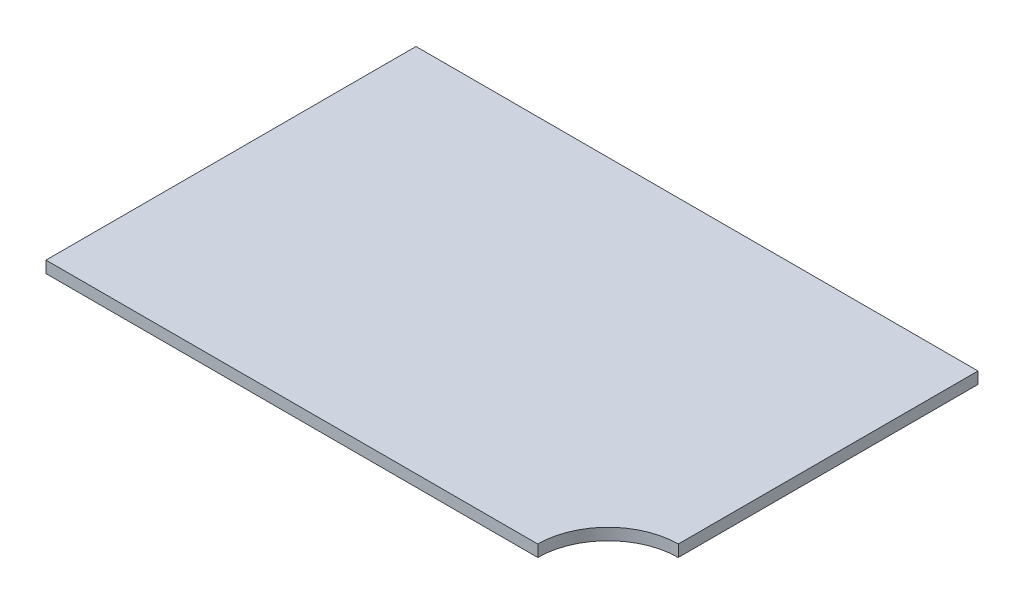
ISO-10303-21;
HEADER;
FILE_DESCRIPTION(('STEP AP214'),'2;1');
FILE_NAME('part.step','',(''),(''),'','','');
FILE_SCHEMA(('AUTOMOTIVE_DESIGN { 1 0 10303 214 1 1 1 1 }'));
ENDSEC;
DATA;
#1=APPLICATION_CONTEXT('core data for automotive mechanical design processes');
#2=APPLICATION_PROTOCOL_DEFINITION('international standard','automotive_design',2000,#1);
#3=PRODUCT_CONTEXT('',#1,'mechanical');
#4=PRODUCT('Part','Part','',(#3));
#5=PRODUCT_RELATED_PRODUCT_CATEGORY('part','',(#4));
#6=PRODUCT_DEFINITION_FORMATION('','',#4);
#7=PRODUCT_DEFINITION_CONTEXT('part definition',#1,'design');
#8=PRODUCT_DEFINITION('design','',#6,#7);
#9=PRODUCT_DEFINITION_SHAPE('','',#8);
#10=(LENGTH_UNIT() NAMED_UNIT(*) SI_UNIT(.MILLI.,.METRE.));
#11=(NAMED_UNIT(*) PLANE_ANGLE_UNIT() SI_UNIT($,.RADIAN.));
#12=(NAMED_UNIT(*) SI_UNIT($,.STERADIAN.) SOLID_ANGLE_UNIT());
#13=UNCERTAINTY_MEASURE_WITH_UNIT(LENGTH_MEASURE(1.E-05),#10,'distance_accuracy_value','');
#14=(GEOMETRIC_REPRESENTATION_CONTEXT(3) GLOBAL_UNCERTAINTY_ASSIGNED_CONTEXT((#13)) GLOBAL_UNIT_ASSIGNED_CONTEXT((#10,
#11,#12)) REPRESENTATION_CONTEXT('',''));
#15=CARTESIAN_POINT('',(0.,0.,0.));
#16=DIRECTION('',(0.,0.,1.));
#17=DIRECTION('',(1.,0.,0.));
#18=AXIS2_PLACEMENT_3D('',#15,#16,#17);
#19=CARTESIAN_POINT('',(-120.,5.,0.));
#20=DIRECTION('',(1.,0.,0.));
#21=DIRECTION('',(0.,0.,-1.));
#22=AXIS2_PLACEMENT_3D('',#19,#20,#21);
#23=PLANE('',#22);
#24=DIRECTION('',(0.,0.,1.));
#25=VECTOR('',#24,1.);
#26=CARTESIAN_POINT('',(-120.,0.,0.));
#27=LINE('',#26,#25);
#28=CARTESIAN_POINT('',(-120.,0.,0.));
#29=VERTEX_POINT('',#28);
#30=CARTESIAN_POINT('',(-120.,0.,158.));
#31=VERTEX_POINT('',#30);
#32=EDGE_CURVE('E115',#29,#31,#27,.T.);
#33=ORIENTED_EDGE('',*,*,#32,.T.);
#34=DIRECTION('',(0.,-1.,0.));
#35=VECTOR('',#34,1.);
#36=CARTESIAN_POINT('',(-120.,5.,158.));
#37=LINE('',#36,#35);
#38=CARTESIAN_POINT('',(-120.,5.,158.));
#39=VERTEX_POINT('',#38);
#40=EDGE_CURVE('E11',#39,#31,#37,.T.);
#41=ORIENTED_EDGE('',*,*,#40,.F.);
#42=DIRECTION('',(0.,0.,1.));
#43=VECTOR('',#42,1.);
#44=CARTESIAN_POINT('',(-120.,5.,0.));
#45=LINE('',#44,#43);
#46=CARTESIAN_POINT('',(-120.,5.,0.));
#47=VERTEX_POINT('',#46);
#48=EDGE_CURVE('E111',#47,#39,#45,.T.);
#49=ORIENTED_EDGE('',*,*,#48,.F.);
#50=DIRECTION('',(0.,-1.,0.));
#51=VECTOR('',#50,1.);
#52=CARTESIAN_POINT('',(-120.,5.,0.));
#53=LINE('',#52,#51);
#54=EDGE_CURVE('E109',#47,#29,#53,.T.);
#55=ORIENTED_EDGE('',*,*,#54,.T.);
#56=EDGE_LOOP('',(#33,#41,#49,#55));
#57=FACE_BOUND('',#56,.T.);
#58=ADVANCED_FACE('F41',(#57),#23,.F.);
#59=CARTESIAN_POINT('',(-120.,5.,158.));
#60=DIRECTION('',(0.,0.,-1.));
#61=DIRECTION('',(-1.,0.,0.));
#62=AXIS2_PLACEMENT_3D('',#59,#60,#61);
#63=PLANE('',#62);
#64=DIRECTION('',(1.,0.,0.));
#65=VECTOR('',#64,1.);
#66=CARTESIAN_POINT('',(-120.,0.,158.));
#67=LINE('',#66,#65);
#68=CARTESIAN_POINT('',(90.,0.,158.));
#69=VERTEX_POINT('',#68);
#70=EDGE_CURVE('E118',#31,#69,#67,.T.);
#71=ORIENTED_EDGE('',*,*,#70,.T.);
#72=DIRECTION('',(0.,-1.,0.));
#73=VECTOR('',#72,1.);
#74=CARTESIAN_POINT('',(90.,5.,158.));
#75=LINE('',#74,#73);
#76=CARTESIAN_POINT('',(90.,5.,158.));
#77=VERTEX_POINT('',#76);
#78=EDGE_CURVE('E55',#77,#69,#75,.T.);
#79=ORIENTED_EDGE('',*,*,#78,.F.);
#80=DIRECTION('',(1.,0.,0.));
#81=VECTOR('',#80,1.);
#82=CARTESIAN_POINT('',(-120.,5.,158.));
#83=LINE('',#82,#81);
#84=EDGE_CURVE('E86',#39,#77,#83,.T.);
#85=ORIENTED_EDGE('',*,*,#84,.F.);
#86=ORIENTED_EDGE('',*,*,#40,.T.);
#87=EDGE_LOOP('',(#71,#79,#85,#86));
#88=FACE_BOUND('',#87,.T.);
#89=ADVANCED_FACE('F133',(#88),#63,.F.);
#90=CARTESIAN_POINT('',(120.,5.,0.));
#91=DIRECTION('',(-1.,0.,0.));
#92=DIRECTION('',(0.,0.,1.));
#93=AXIS2_PLACEMENT_3D('',#90,#91,#92);
#94=PLANE('',#93);
#95=DIRECTION('',(0.,0.,-1.));
#96=VECTOR('',#95,1.);
#97=CARTESIAN_POINT('',(120.,5.,0.));
#98=LINE('',#97,#96);
#99=CARTESIAN_POINT('',(120.,5.,128.));
#100=VERTEX_POINT('',#99);
#101=CARTESIAN_POINT('',(120.,5.,0.));
#102=VERTEX_POINT('',#101);
#103=EDGE_CURVE('E104',#100,#102,#98,.T.);
#104=ORIENTED_EDGE('',*,*,#103,.F.);
#105=DIRECTION('',(0.,-1.,0.));
#106=VECTOR('',#105,1.);
#107=CARTESIAN_POINT('',(120.,5.,128.));
#108=LINE('',#107,#106);
#109=CARTESIAN_POINT('',(120.,0.,128.));
#110=VERTEX_POINT('',#109);
#111=EDGE_CURVE('E94',#100,#110,#108,.T.);
#112=ORIENTED_EDGE('',*,*,#111,.T.);
#113=DIRECTION('',(0.,0.,-1.));
#114=VECTOR('',#113,1.);
#115=CARTESIAN_POINT('',(120.,0.,0.));
#116=LINE('',#115,#114);
#117=CARTESIAN_POINT('',(120.,0.,0.));
#118=VERTEX_POINT('',#117);
#119=EDGE_CURVE('E121',#110,#118,#116,.T.);
#120=ORIENTED_EDGE('',*,*,#119,.T.);
#121=DIRECTION('',(0.,-1.,0.));
#122=VECTOR('',#121,1.);
#123=CARTESIAN_POINT('',(120.,5.,0.));
#124=LINE('',#123,#122);
#125=EDGE_CURVE('E48',#102,#118,#124,.T.);
#126=ORIENTED_EDGE('',*,*,#125,.F.);
#127=EDGE_LOOP('',(#104,#112,#120,#126));
#128=FACE_BOUND('',#127,.T.);
#129=ADVANCED_FACE('F107',(#128),#94,.F.);
#130=CARTESIAN_POINT('',(-120.,5.,0.));
#131=DIRECTION('',(0.,0.,1.));
#132=DIRECTION('',(1.,0.,0.));
#133=AXIS2_PLACEMENT_3D('',#130,#131,#132);
#134=PLANE('',#133);
#135=DIRECTION('',(-1.,0.,0.));
#136=VECTOR('',#135,1.);
#137=CARTESIAN_POINT('',(-120.,0.,0.));
#138=LINE('',#137,#136);
#139=EDGE_CURVE('E81',#118,#29,#138,.T.);
#140=ORIENTED_EDGE('',*,*,#139,.T.);
#141=ORIENTED_EDGE('',*,*,#54,.F.);
#142=DIRECTION('',(-1.,0.,0.));
#143=VECTOR('',#142,1.);
#144=CARTESIAN_POINT('',(-120.,5.,0.));
#145=LINE('',#144,#143);
#146=EDGE_CURVE('E64',#102,#47,#145,.T.);
#147=ORIENTED_EDGE('',*,*,#146,.F.);
#148=ORIENTED_EDGE('',*,*,#125,.T.);
#149=EDGE_LOOP('',(#140,#141,#147,#148));
#150=FACE_BOUND('',#149,.T.);
#151=ADVANCED_FACE('F124',(#150),#134,.F.);
#152=CARTESIAN_POINT('',(0.,5.,0.));
#153=DIRECTION('',(0.,1.,0.));
#154=DIRECTION('',(0.,0.,1.));
#155=AXIS2_PLACEMENT_3D('',#152,#153,#154);
#156=PLANE('',#155);
#157=CARTESIAN_POINT('',(120.,5.,158.));
#158=DIRECTION('',(0.,-1.,0.));
#159=DIRECTION('',(0.,0.,1.));
#160=AXIS2_PLACEMENT_3D('',#157,#158,#159);
#161=CIRCLE('',#160,30.);
#162=EDGE_CURVE('E97',#77,#100,#161,.T.);
#163=ORIENTED_EDGE('',*,*,#162,.T.);
#164=ORIENTED_EDGE('',*,*,#103,.T.);
#165=ORIENTED_EDGE('',*,*,#146,.T.);
#166=ORIENTED_EDGE('',*,*,#48,.T.);
#167=ORIENTED_EDGE('',*,*,#84,.T.);
#168=EDGE_LOOP('',(#163,#164,#165,#166,#167));
#169=FACE_BOUND('',#168,.T.);
#170=ADVANCED_FACE('F103',(#169),#156,.T.);
#171=CARTESIAN_POINT('',(0.,0.,0.));
#172=DIRECTION('',(0.,1.,0.));
#173=DIRECTION('',(0.,0.,1.));
#174=AXIS2_PLACEMENT_3D('',#171,#172,#173);
#175=PLANE('',#174);
#176=ORIENTED_EDGE('',*,*,#119,.F.);
#177=CARTESIAN_POINT('',(120.,0.,158.));
#178=DIRECTION('',(0.,-1.,0.));
#179=DIRECTION('',(0.,0.,1.));
#180=AXIS2_PLACEMENT_3D('',#177,#178,#179);
#181=CIRCLE('',#180,30.);
#182=EDGE_CURVE('E98',#69,#110,#181,.T.);
#183=ORIENTED_EDGE('',*,*,#182,.F.);
#184=ORIENTED_EDGE('',*,*,#70,.F.);
#185=ORIENTED_EDGE('',*,*,#32,.F.);
#186=ORIENTED_EDGE('',*,*,#139,.F.);
#187=EDGE_LOOP('',(#176,#183,#184,#185,#186));
#188=FACE_BOUND('',#187,.T.);
#189=ADVANCED_FACE('F127',(#188),#175,.F.);
#190=CARTESIAN_POINT('',(120.,5.,158.));
#191=DIRECTION('',(0.,-1.,0.));
#192=DIRECTION('',(0.,0.,-1.));
#193=AXIS2_PLACEMENT_3D('',#190,#191,#192);
#194=CYLINDRICAL_SURFACE('',#193,30.);
#195=ORIENTED_EDGE('',*,*,#182,.T.);
#196=ORIENTED_EDGE('',*,*,#111,.F.);
#197=ORIENTED_EDGE('',*,*,#162,.F.);
#198=ORIENTED_EDGE('',*,*,#78,.T.);
#199=EDGE_LOOP('',(#195,#196,#197,#198));
#200=FACE_BOUND('',#199,.T.);
#201=ADVANCED_FACE('F96',(#200),#194,.F.);
#202=CLOSED_SHELL('',(#58,#89,#129,#151,#170,#189,#201));
#203=MANIFOLD_SOLID_BREP('B2',#202);
#204=ADVANCED_BREP_SHAPE_REPRESENTATION('',(#18,#203),#14);
#205=SHAPE_DEFINITION_REPRESENTATION(#9,#204);
ENDSEC;
END-ISO-10303-21;
